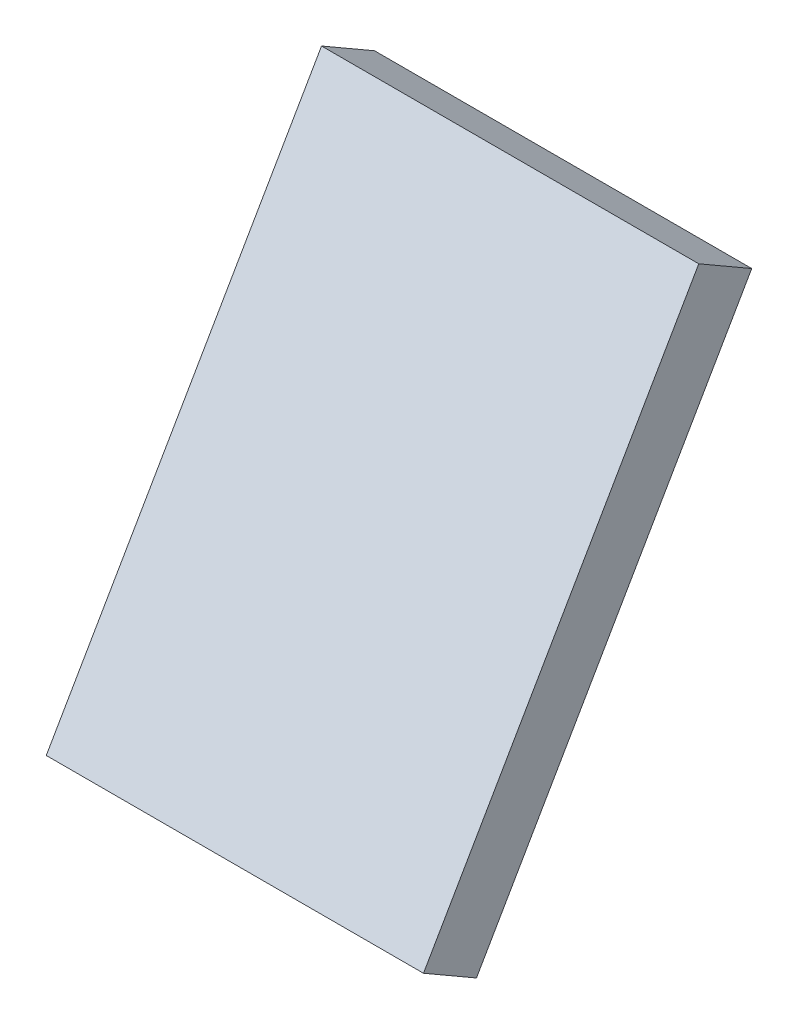
ISO-10303-21;
HEADER;
FILE_DESCRIPTION(('STEP AP214'),'2;1');
FILE_NAME('part.step','',(''),(''),'','','');
FILE_SCHEMA(('AUTOMOTIVE_DESIGN { 1 0 10303 214 1 1 1 1 }'));
ENDSEC;
DATA;
#1=APPLICATION_CONTEXT('core data for automotive mechanical design processes');
#2=APPLICATION_PROTOCOL_DEFINITION('international standard','automotive_design',2000,#1);
#3=PRODUCT_CONTEXT('',#1,'mechanical');
#4=PRODUCT('Part','Part','',(#3));
#5=PRODUCT_RELATED_PRODUCT_CATEGORY('part','',(#4));
#6=PRODUCT_DEFINITION_FORMATION('','',#4);
#7=PRODUCT_DEFINITION_CONTEXT('part definition',#1,'design');
#8=PRODUCT_DEFINITION('design','',#6,#7);
#9=PRODUCT_DEFINITION_SHAPE('','',#8);
#10=(LENGTH_UNIT() NAMED_UNIT(*) SI_UNIT(.MILLI.,.METRE.));
#11=(NAMED_UNIT(*) PLANE_ANGLE_UNIT() SI_UNIT($,.RADIAN.));
#12=(NAMED_UNIT(*) SI_UNIT($,.STERADIAN.) SOLID_ANGLE_UNIT());
#13=UNCERTAINTY_MEASURE_WITH_UNIT(LENGTH_MEASURE(1.E-05),#10,'distance_accuracy_value','');
#14=(GEOMETRIC_REPRESENTATION_CONTEXT(3) GLOBAL_UNCERTAINTY_ASSIGNED_CONTEXT((#13)) GLOBAL_UNIT_ASSIGNED_CONTEXT((#10,
#11,#12)) REPRESENTATION_CONTEXT('',''));
#15=CARTESIAN_POINT('',(0.,0.,0.));
#16=DIRECTION('',(0.,0.,1.));
#17=DIRECTION('',(1.,0.,0.));
#18=AXIS2_PLACEMENT_3D('',#15,#16,#17);
#19=CARTESIAN_POINT('',(52.8749999999999,30.3179152817722,11.2535403559091));
#20=DIRECTION('',(0.,-0.5,-0.866025403784439));
#21=DIRECTION('',(0.,0.866025403784439,-0.5));
#22=AXIS2_PLACEMENT_3D('',#19,#20,#21);
#23=PLANE('',#22);
#24=DIRECTION('',(1.,0.,0.));
#25=VECTOR('',#24,1.);
#26=CARTESIAN_POINT('',(18.5,20.6080219542991,16.8595498823282));
#27=LINE('',#26,#25);
#28=CARTESIAN_POINT('',(18.5,20.6080219542991,16.8595498823282));
#29=VERTEX_POINT('',#28);
#30=CARTESIAN_POINT('',(0.,20.6080219542991,16.8595498823282));
#31=VERTEX_POINT('',#30);
#32=EDGE_CURVE('E79',#29,#31,#27,.F.);
#33=ORIENTED_EDGE('',*,*,#32,.F.);
#34=DIRECTION('',(0.,-0.866025403784438,0.500000000000001));
#35=VECTOR('',#34,1.);
#36=CARTESIAN_POINT('',(18.5,43.9907078564789,3.35954988232819));
#37=LINE('',#36,#35);
#38=CARTESIAN_POINT('',(18.5,43.9907078564789,3.35954988232822));
#39=VERTEX_POINT('',#38);
#40=EDGE_CURVE('E55',#39,#29,#37,.T.);
#41=ORIENTED_EDGE('',*,*,#40,.F.);
#42=DIRECTION('',(1.,0.,0.));
#43=VECTOR('',#42,1.);
#44=CARTESIAN_POINT('',(0.,43.9907078564789,3.35954988232819));
#45=LINE('',#44,#43);
#46=CARTESIAN_POINT('',(0.,43.9907078564789,3.35954988232822));
#47=VERTEX_POINT('',#46);
#48=EDGE_CURVE('E57',#47,#39,#45,.T.);
#49=ORIENTED_EDGE('',*,*,#48,.F.);
#50=DIRECTION('',(0.,0.866025403784438,-0.500000000000001));
#51=VECTOR('',#50,1.);
#52=CARTESIAN_POINT('',(0.,20.6080219542991,16.8595498823282));
#53=LINE('',#52,#51);
#54=EDGE_CURVE('E20',#31,#47,#53,.T.);
#55=ORIENTED_EDGE('',*,*,#54,.F.);
#56=EDGE_LOOP('',(#33,#41,#49,#55));
#57=FACE_BOUND('',#56,.T.);
#58=ADVANCED_FACE('F17',(#57),#23,.F.);
#59=CARTESIAN_POINT('',(0.,10.5827044069936,24.4951905283833));
#60=DIRECTION('',(-1.,0.,0.));
#61=DIRECTION('',(0.,0.,1.));
#62=AXIS2_PLACEMENT_3D('',#59,#60,#61);
#63=PLANE('',#62);
#64=DIRECTION('',(0.,0.866025403784439,-0.5));
#65=VECTOR('',#64,1.);
#66=CARTESIAN_POINT('',(0.,30.799364905389,7.51147367097487));
#67=LINE('',#66,#65);
#68=CARTESIAN_POINT('',(0.,19.1080219542991,14.2614736709749));
#69=VERTEX_POINT('',#68);
#70=CARTESIAN_POINT('',(0.,42.490707856479,0.761473670974875));
#71=VERTEX_POINT('',#70);
#72=EDGE_CURVE('E83',#69,#71,#67,.T.);
#73=ORIENTED_EDGE('',*,*,#72,.F.);
#74=DIRECTION('',(0.,-0.5,-0.866025403784439));
#75=VECTOR('',#74,1.);
#76=CARTESIAN_POINT('',(0.,20.6080219542991,16.8595498823282));
#77=LINE('',#76,#75);
#78=EDGE_CURVE('E68',#31,#69,#77,.T.);
#79=ORIENTED_EDGE('',*,*,#78,.F.);
#80=ORIENTED_EDGE('',*,*,#54,.T.);
#81=DIRECTION('',(0.,0.5,0.866025403784439));
#82=VECTOR('',#81,1.);
#83=CARTESIAN_POINT('',(0.,43.9907078564789,3.35954988232819));
#84=LINE('',#83,#82);
#85=EDGE_CURVE('E63',#71,#47,#84,.T.);
#86=ORIENTED_EDGE('',*,*,#85,.F.);
#87=EDGE_LOOP('',(#73,#79,#80,#86));
#88=FACE_BOUND('',#87,.T.);
#89=ADVANCED_FACE('F65',(#88),#63,.T.);
#90=CARTESIAN_POINT('',(0.,43.9907078564789,3.35954988232819));
#91=DIRECTION('',(0.,0.866025403784439,-0.5));
#92=DIRECTION('',(0.,0.5,0.866025403784439));
#93=AXIS2_PLACEMENT_3D('',#90,#91,#92);
#94=PLANE('',#93);
#95=DIRECTION('',(1.,0.,0.));
#96=VECTOR('',#95,1.);
#97=CARTESIAN_POINT('',(9.25,42.490707856479,0.761473670974839));
#98=LINE('',#97,#96);
#99=CARTESIAN_POINT('',(18.5,42.490707856479,0.761473670974886));
#100=VERTEX_POINT('',#99);
#101=EDGE_CURVE('E72',#71,#100,#98,.T.);
#102=ORIENTED_EDGE('',*,*,#101,.F.);
#103=ORIENTED_EDGE('',*,*,#85,.T.);
#104=ORIENTED_EDGE('',*,*,#48,.T.);
#105=DIRECTION('',(0.,0.499999999999974,0.866025403784454));
#106=VECTOR('',#105,1.);
#107=CARTESIAN_POINT('',(18.5,42.490707856479,0.761473670974873));
#108=LINE('',#107,#106);
#109=EDGE_CURVE('E75',#100,#39,#108,.T.);
#110=ORIENTED_EDGE('',*,*,#109,.F.);
#111=EDGE_LOOP('',(#102,#103,#104,#110));
#112=FACE_BOUND('',#111,.T.);
#113=ADVANCED_FACE('F70',(#112),#94,.T.);
#114=CARTESIAN_POINT('',(18.5,43.9907078564789,3.35954988232819));
#115=DIRECTION('',(1.,0.,0.));
#116=DIRECTION('',(0.,0.,-1.));
#117=AXIS2_PLACEMENT_3D('',#114,#115,#116);
#118=PLANE('',#117);
#119=DIRECTION('',(0.,0.866025403784439,-0.5));
#120=VECTOR('',#119,1.);
#121=CARTESIAN_POINT('',(18.5,30.799364905389,7.51147367097487));
#122=LINE('',#121,#120);
#123=CARTESIAN_POINT('',(18.5,19.1080219542991,14.2614736709749));
#124=VERTEX_POINT('',#123);
#125=EDGE_CURVE('E26',#100,#124,#122,.F.);
#126=ORIENTED_EDGE('',*,*,#125,.F.);
#127=ORIENTED_EDGE('',*,*,#109,.T.);
#128=ORIENTED_EDGE('',*,*,#40,.T.);
#129=DIRECTION('',(0.,-0.5,-0.866025403784439));
#130=VECTOR('',#129,1.);
#131=CARTESIAN_POINT('',(18.5,20.6080219542991,16.8595498823282));
#132=LINE('',#131,#130);
#133=EDGE_CURVE('E35',#124,#29,#132,.F.);
#134=ORIENTED_EDGE('',*,*,#133,.F.);
#135=EDGE_LOOP('',(#126,#127,#128,#134));
#136=FACE_BOUND('',#135,.T.);
#137=ADVANCED_FACE('F89',(#136),#118,.T.);
#138=CARTESIAN_POINT('',(18.5,20.6080219542991,16.8595498823282));
#139=DIRECTION('',(0.,-0.866025403784439,0.5));
#140=DIRECTION('',(0.,-0.5,-0.866025403784439));
#141=AXIS2_PLACEMENT_3D('',#138,#139,#140);
#142=PLANE('',#141);
#143=DIRECTION('',(1.,0.,0.));
#144=VECTOR('',#143,1.);
#145=CARTESIAN_POINT('',(9.25,19.1080219542991,14.2614736709749));
#146=LINE('',#145,#144);
#147=EDGE_CURVE('E11',#124,#69,#146,.F.);
#148=ORIENTED_EDGE('',*,*,#147,.F.);
#149=ORIENTED_EDGE('',*,*,#133,.T.);
#150=ORIENTED_EDGE('',*,*,#32,.T.);
#151=ORIENTED_EDGE('',*,*,#78,.T.);
#152=EDGE_LOOP('',(#148,#149,#150,#151));
#153=FACE_BOUND('',#152,.T.);
#154=ADVANCED_FACE('F91',(#153),#142,.T.);
#155=CARTESIAN_POINT('',(9.25,30.799364905389,7.51147367097487));
#156=DIRECTION('',(0.,-0.5,-0.866025403784439));
#157=DIRECTION('',(0.,0.866025403784439,-0.5));
#158=AXIS2_PLACEMENT_3D('',#155,#156,#157);
#159=PLANE('',#158);
#160=ORIENTED_EDGE('',*,*,#125,.T.);
#161=ORIENTED_EDGE('',*,*,#147,.T.);
#162=ORIENTED_EDGE('',*,*,#72,.T.);
#163=ORIENTED_EDGE('',*,*,#101,.T.);
#164=EDGE_LOOP('',(#160,#161,#162,#163));
#165=FACE_BOUND('',#164,.T.);
#166=ADVANCED_FACE('F88',(#165),#159,.T.);
#167=CLOSED_SHELL('',(#58,#89,#113,#137,#154,#166));
#168=MANIFOLD_SOLID_BREP('B1',#167);
#169=ADVANCED_BREP_SHAPE_REPRESENTATION('',(#18,#168),#14);
#170=SHAPE_DEFINITION_REPRESENTATION(#9,#169);
ENDSEC;
END-ISO-10303-21;
